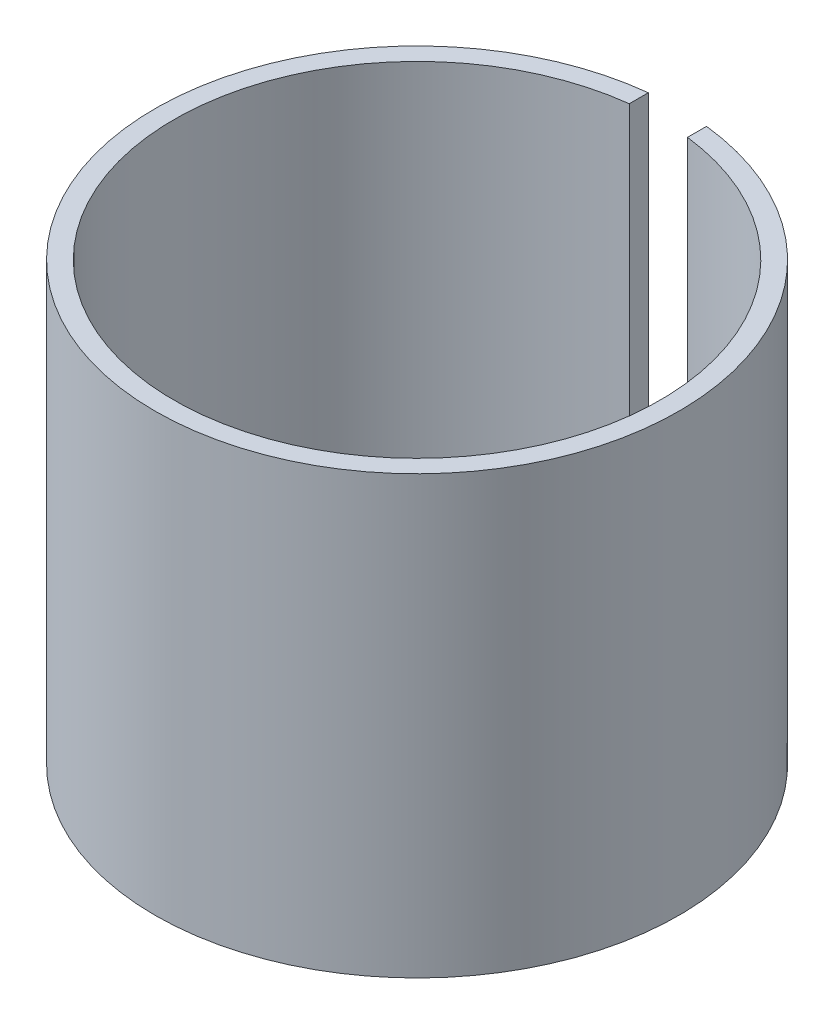
ISO-10303-21;
HEADER;
FILE_DESCRIPTION(('STEP AP214'),'2;1');
FILE_NAME('part.step','',(''),(''),'','','');
FILE_SCHEMA(('AUTOMOTIVE_DESIGN { 1 0 10303 214 1 1 1 1 }'));
ENDSEC;
DATA;
#1=APPLICATION_CONTEXT('core data for automotive mechanical design processes');
#2=APPLICATION_PROTOCOL_DEFINITION('international standard','automotive_design',2000,#1);
#3=PRODUCT_CONTEXT('',#1,'mechanical');
#4=PRODUCT('Part','Part','',(#3));
#5=PRODUCT_RELATED_PRODUCT_CATEGORY('part','',(#4));
#6=PRODUCT_DEFINITION_FORMATION('','',#4);
#7=PRODUCT_DEFINITION_CONTEXT('part definition',#1,'design');
#8=PRODUCT_DEFINITION('design','',#6,#7);
#9=PRODUCT_DEFINITION_SHAPE('','',#8);
#10=(LENGTH_UNIT() NAMED_UNIT(*) SI_UNIT(.MILLI.,.METRE.));
#11=(NAMED_UNIT(*) PLANE_ANGLE_UNIT() SI_UNIT($,.RADIAN.));
#12=(NAMED_UNIT(*) SI_UNIT($,.STERADIAN.) SOLID_ANGLE_UNIT());
#13=UNCERTAINTY_MEASURE_WITH_UNIT(LENGTH_MEASURE(1.E-05),#10,'distance_accuracy_value','');
#14=(GEOMETRIC_REPRESENTATION_CONTEXT(3) GLOBAL_UNCERTAINTY_ASSIGNED_CONTEXT((#13)) GLOBAL_UNIT_ASSIGNED_CONTEXT((#10,
#11,#12)) REPRESENTATION_CONTEXT('',''));
#15=CARTESIAN_POINT('',(0.,0.,0.));
#16=DIRECTION('',(0.,0.,1.));
#17=DIRECTION('',(1.,0.,0.));
#18=AXIS2_PLACEMENT_3D('',#15,#16,#17);
#19=CARTESIAN_POINT('',(0.,5.,0.));
#20=DIRECTION('',(0.,-1.,0.));
#21=DIRECTION('',(0.,0.,-1.));
#22=AXIS2_PLACEMENT_3D('',#19,#20,#21);
#23=CYLINDRICAL_SURFACE('',#22,18.);
#24=CARTESIAN_POINT('',(0.,30.,0.));
#25=DIRECTION('',(0.,1.,0.));
#26=DIRECTION('',(0.,0.,1.));
#27=AXIS2_PLACEMENT_3D('',#24,#25,#26);
#28=CIRCLE('',#27,18.);
#29=CARTESIAN_POINT('',(-2.,30.,-17.8885438199983));
#30=VERTEX_POINT('',#29);
#31=CARTESIAN_POINT('',(2.00000000000001,30.,-17.8885438199983));
#32=VERTEX_POINT('',#31);
#33=EDGE_CURVE('E111',#30,#32,#28,.T.);
#34=ORIENTED_EDGE('',*,*,#33,.F.);
#35=DIRECTION('',(0.,-1.,0.));
#36=VECTOR('',#35,1.);
#37=CARTESIAN_POINT('',(-2.,5.,-17.8885438199983));
#38=LINE('',#37,#36);
#39=CARTESIAN_POINT('',(-2.,5.,-17.8885438199983));
#40=VERTEX_POINT('',#39);
#41=EDGE_CURVE('E107',#30,#40,#38,.T.);
#42=ORIENTED_EDGE('',*,*,#41,.T.);
#43=CARTESIAN_POINT('',(0.,5.,0.));
#44=DIRECTION('',(0.,1.,0.));
#45=DIRECTION('',(0.,0.,1.));
#46=AXIS2_PLACEMENT_3D('',#43,#44,#45);
#47=CIRCLE('',#46,18.);
#48=CARTESIAN_POINT('',(2.00000000000001,5.,-17.8885438199983));
#49=VERTEX_POINT('',#48);
#50=EDGE_CURVE('E103',#49,#40,#47,.T.);
#51=ORIENTED_EDGE('',*,*,#50,.F.);
#52=DIRECTION('',(0.,-1.,0.));
#53=VECTOR('',#52,1.);
#54=CARTESIAN_POINT('',(2.00000000000001,5.,-17.8885438199983));
#55=LINE('',#54,#53);
#56=EDGE_CURVE('E88',#49,#32,#55,.F.);
#57=ORIENTED_EDGE('',*,*,#56,.T.);
#58=EDGE_LOOP('',(#34,#42,#51,#57));
#59=FACE_BOUND('',#58,.T.);
#60=CARTESIAN_POINT('',(0.,0.,0.));
#61=DIRECTION('',(0.,1.,0.));
#62=DIRECTION('',(0.,0.,1.));
#63=AXIS2_PLACEMENT_3D('',#60,#61,#62);
#64=CIRCLE('',#63,18.);
#65=CARTESIAN_POINT('',(0.,0.,18.));
#66=VERTEX_POINT('',#65);
#67=EDGE_CURVE('E54',#66,#66,#64,.T.);
#68=ORIENTED_EDGE('',*,*,#67,.T.);
#69=EDGE_LOOP('',(#68));
#70=FACE_BOUND('',#69,.T.);
#71=ADVANCED_FACE('F45',(#59,#70),#23,.T.);
#72=CARTESIAN_POINT('',(0.,0.,0.));
#73=DIRECTION('',(0.,1.,0.));
#74=DIRECTION('',(0.,0.,1.));
#75=AXIS2_PLACEMENT_3D('',#72,#73,#74);
#76=PLANE('',#75);
#77=CARTESIAN_POINT('',(0.,0.,-10.));
#78=DIRECTION('',(0.,-1.,0.));
#79=DIRECTION('',(0.,0.,-1.));
#80=AXIS2_PLACEMENT_3D('',#77,#78,#79);
#81=CIRCLE('',#80,2.);
#82=CARTESIAN_POINT('',(-1.71246204336909,0.,-8.96681378734511));
#83=VERTEX_POINT('',#82);
#84=EDGE_CURVE('E153',#83,#83,#81,.T.);
#85=ORIENTED_EDGE('',*,*,#84,.F.);
#86=EDGE_LOOP('',(#85));
#87=FACE_BOUND('',#86,.T.);
#88=ORIENTED_EDGE('',*,*,#67,.F.);
#89=EDGE_LOOP('',(#88));
#90=FACE_BOUND('',#89,.T.);
#91=ADVANCED_FACE('F140',(#87,#90),#76,.F.);
#92=CARTESIAN_POINT('',(0.,30.,0.));
#93=DIRECTION('',(0.,1.,0.));
#94=DIRECTION('',(0.,0.,1.));
#95=AXIS2_PLACEMENT_3D('',#92,#93,#94);
#96=PLANE('',#95);
#97=DIRECTION('',(0.,0.,1.));
#98=VECTOR('',#97,1.);
#99=CARTESIAN_POINT('',(-1.99999999999999,30.,-14.3872192523656));
#100=LINE('',#99,#98);
#101=CARTESIAN_POINT('',(-2.,30.,-16.5798069952578));
#102=VERTEX_POINT('',#101);
#103=EDGE_CURVE('E69',#30,#102,#100,.T.);
#104=ORIENTED_EDGE('',*,*,#103,.F.);
#105=ORIENTED_EDGE('',*,*,#33,.T.);
#106=DIRECTION('',(0.,0.,-1.));
#107=VECTOR('',#106,1.);
#108=CARTESIAN_POINT('',(2.00000000000001,30.,-14.3872192523656));
#109=LINE('',#108,#107);
#110=CARTESIAN_POINT('',(2.00000000000001,30.,-16.5798069952578));
#111=VERTEX_POINT('',#110);
#112=EDGE_CURVE('E94',#111,#32,#109,.T.);
#113=ORIENTED_EDGE('',*,*,#112,.F.);
#114=CARTESIAN_POINT('',(0.,30.,0.));
#115=DIRECTION('',(0.,1.,0.));
#116=DIRECTION('',(0.,0.,1.));
#117=AXIS2_PLACEMENT_3D('',#114,#115,#116);
#118=CIRCLE('',#117,16.7);
#119=EDGE_CURVE('E108',#102,#111,#118,.T.);
#120=ORIENTED_EDGE('',*,*,#119,.F.);
#121=EDGE_LOOP('',(#104,#105,#113,#120));
#122=FACE_BOUND('',#121,.T.);
#123=ADVANCED_FACE('F138',(#122),#96,.T.);
#124=CARTESIAN_POINT('',(0.,30.,0.));
#125=DIRECTION('',(0.,-1.,0.));
#126=DIRECTION('',(0.,0.,-1.));
#127=AXIS2_PLACEMENT_3D('',#124,#125,#126);
#128=CYLINDRICAL_SURFACE('',#127,16.7);
#129=DIRECTION('',(0.,-1.,0.));
#130=VECTOR('',#129,1.);
#131=CARTESIAN_POINT('',(-2.,30.,-16.5798069952578));
#132=LINE('',#131,#130);
#133=CARTESIAN_POINT('',(-2.,5.,-16.5798069952578));
#134=VERTEX_POINT('',#133);
#135=EDGE_CURVE('E99',#102,#134,#132,.T.);
#136=ORIENTED_EDGE('',*,*,#135,.F.);
#137=ORIENTED_EDGE('',*,*,#119,.T.);
#138=DIRECTION('',(0.,-1.,0.));
#139=VECTOR('',#138,1.);
#140=CARTESIAN_POINT('',(2.00000000000001,30.,-16.5798069952578));
#141=LINE('',#140,#139);
#142=CARTESIAN_POINT('',(2.00000000000001,5.,-16.5798069952578));
#143=VERTEX_POINT('',#142);
#144=EDGE_CURVE('E100',#143,#111,#141,.F.);
#145=ORIENTED_EDGE('',*,*,#144,.F.);
#146=CARTESIAN_POINT('',(0.,5.,0.));
#147=DIRECTION('',(0.,1.,0.));
#148=DIRECTION('',(0.,0.,1.));
#149=AXIS2_PLACEMENT_3D('',#146,#147,#148);
#150=CIRCLE('',#149,16.7);
#151=EDGE_CURVE('E12',#143,#134,#150,.F.);
#152=ORIENTED_EDGE('',*,*,#151,.T.);
#153=EDGE_LOOP('',(#136,#137,#145,#152));
#154=FACE_BOUND('',#153,.T.);
#155=ADVANCED_FACE('F137',(#154),#128,.F.);
#156=CARTESIAN_POINT('',(0.,5.,0.));
#157=DIRECTION('',(0.,1.,0.));
#158=DIRECTION('',(0.,0.,1.));
#159=AXIS2_PLACEMENT_3D('',#156,#157,#158);
#160=PLANE('',#159);
#161=CARTESIAN_POINT('',(0.,5.,-15.));
#162=DIRECTION('',(0.,1.,0.));
#163=DIRECTION('',(0.,0.,1.));
#164=AXIS2_PLACEMENT_3D('',#161,#162,#163);
#165=CIRCLE('',#164,2.);
#166=CARTESIAN_POINT('',(-1.50932755364611,5.,-13.6877765678801));
#167=VERTEX_POINT('',#166);
#168=EDGE_CURVE('E123',#167,#167,#165,.T.);
#169=ORIENTED_EDGE('',*,*,#168,.F.);
#170=EDGE_LOOP('',(#169));
#171=FACE_BOUND('',#170,.T.);
#172=ORIENTED_EDGE('',*,*,#151,.F.);
#173=DIRECTION('',(0.,0.,1.));
#174=VECTOR('',#173,1.);
#175=CARTESIAN_POINT('',(2.00000000000001,5.,-14.3872192523656));
#176=LINE('',#175,#174);
#177=EDGE_CURVE('E91',#49,#143,#176,.T.);
#178=ORIENTED_EDGE('',*,*,#177,.F.);
#179=ORIENTED_EDGE('',*,*,#50,.T.);
#180=DIRECTION('',(0.,0.,-1.));
#181=VECTOR('',#180,1.);
#182=CARTESIAN_POINT('',(-1.99999999999999,5.,-14.3872192523656));
#183=LINE('',#182,#181);
#184=EDGE_CURVE('E62',#134,#40,#183,.T.);
#185=ORIENTED_EDGE('',*,*,#184,.F.);
#186=EDGE_LOOP('',(#172,#178,#179,#185));
#187=FACE_BOUND('',#186,.T.);
#188=ADVANCED_FACE('F102',(#171,#187),#160,.T.);
#189=CARTESIAN_POINT('',(-1.99999999999999,-1.11521210969115,-14.3872192523656));
#190=DIRECTION('',(-1.,0.,0.));
#191=DIRECTION('',(0.,0.,1.));
#192=AXIS2_PLACEMENT_3D('',#189,#190,#191);
#193=PLANE('',#192);
#194=ORIENTED_EDGE('',*,*,#103,.T.);
#195=ORIENTED_EDGE('',*,*,#135,.T.);
#196=ORIENTED_EDGE('',*,*,#184,.T.);
#197=ORIENTED_EDGE('',*,*,#41,.F.);
#198=EDGE_LOOP('',(#194,#195,#196,#197));
#199=FACE_BOUND('',#198,.T.);
#200=ADVANCED_FACE('F136',(#199),#193,.F.);
#201=CARTESIAN_POINT('',(2.00000000000001,-1.11521210969115,-14.3872192523656));
#202=DIRECTION('',(1.,0.,0.));
#203=DIRECTION('',(0.,0.,-1.));
#204=AXIS2_PLACEMENT_3D('',#201,#202,#203);
#205=PLANE('',#204);
#206=ORIENTED_EDGE('',*,*,#177,.T.);
#207=ORIENTED_EDGE('',*,*,#144,.T.);
#208=ORIENTED_EDGE('',*,*,#112,.T.);
#209=ORIENTED_EDGE('',*,*,#56,.F.);
#210=EDGE_LOOP('',(#206,#207,#208,#209));
#211=FACE_BOUND('',#210,.T.);
#212=ADVANCED_FACE('F90',(#211),#205,.F.);
#213=CARTESIAN_POINT('',(-1.71246204336909,0.,-8.96681378734511));
#214=CARTESIAN_POINT('',(-1.50932755364611,5.,-13.6877765678801));
#215=CARTESIAN_POINT('',(-1.62636319231452,0.,-8.82410861706435));
#216=CARTESIAN_POINT('',(-1.39997560096945,5.,-13.5619992717429));
#217=CARTESIAN_POINT('',(-1.51161522329544,0.,-8.673150148731));
#218=CARTESIAN_POINT('',(-1.26098215289133,5.,-13.433017191798));
#219=CARTESIAN_POINT('',(-1.19772762088648,0.,-8.38415357868493));
#220=CARTESIAN_POINT('',(-0.902081628122035,5.,-13.2022903884899));
#221=CARTESIAN_POINT('',(-0.997261399921723,0.,-8.24598152480161));
#222=CARTESIAN_POINT('',(-0.680844687362737,5.,-13.1006417866024));
#223=CARTESIAN_POINT('',(-0.502854414282958,0.,-8.04596608290765));
#224=CARTESIAN_POINT('',(-0.159411279927104,5.,-12.9886076576304));
#225=CARTESIAN_POINT('',(-0.20751605977832,0.,-7.98620736714704));
#226=CARTESIAN_POINT('',(0.141803549701195,5.,-12.9805160469836));
#227=CARTESIAN_POINT('',(0.41905686482192,0.,-8.01939023852643));
#228=CARTESIAN_POINT('',(0.753341280020018,5.,-13.120930922234));
#229=CARTESIAN_POINT('',(0.747775872093373,0.,-8.11534025452176));
#230=CARTESIAN_POINT('',(1.06066883984559,5.,-13.2719685410006));
#231=CARTESIAN_POINT('',(1.3185965532164,0.,-8.45973565874005));
#232=CARTESIAN_POINT('',(1.5637780243943,5.,-13.7093763517072));
#233=CARTESIAN_POINT('',(1.55674791093564,0.,-8.70579768776428));
#234=CARTESIAN_POINT('',(1.75607792465688,5.,-13.9927194999745));
#235=CARTESIAN_POINT('',(1.87825085809684,0.,-9.2446210240831));
#236=CARTESIAN_POINT('',(1.98015406486878,5.,-14.5787951061746));
#237=CARTESIAN_POINT('',(1.96309092816853,0.,-9.5337542291307));
#238=CARTESIAN_POINT('',(2.01402039732329,5.,-14.8782093998831));
#239=CARTESIAN_POINT('',(2.01667179640788,0.,-10.0643892590742));
#240=CARTESIAN_POINT('',(1.97557180705442,5.,-15.4101550271335));
#241=CARTESIAN_POINT('',(1.98790843632494,0.,-10.3061554505464));
#242=CARTESIAN_POINT('',(1.90567010900737,5.,-15.6433758984816));
#243=CARTESIAN_POINT('',(1.87860296603046,0.,-10.7185833334643));
#244=CARTESIAN_POINT('',(1.72708391598033,5.,-16.0308696611469));
#245=CARTESIAN_POINT('',(1.79856089442367,0.,-10.8904810423741));
#246=CARTESIAN_POINT('',(1.61867950632277,5.,-16.1864461359828));
#247=CARTESIAN_POINT('',(1.62636319231452,0.,-11.1758913829356));
#248=CARTESIAN_POINT('',(1.39997560096945,5.,-16.4380007282571));
#249=CARTESIAN_POINT('',(1.51161522329544,0.,-11.326849851269));
#250=CARTESIAN_POINT('',(1.26098215289133,5.,-16.566982808202));
#251=CARTESIAN_POINT('',(1.19772762088648,0.,-11.6158464213151));
#252=CARTESIAN_POINT('',(0.902081628122036,5.,-16.7977096115101));
#253=CARTESIAN_POINT('',(0.997261399921723,0.,-11.7540184751984));
#254=CARTESIAN_POINT('',(0.680844687362738,5.,-16.8993582133977));
#255=CARTESIAN_POINT('',(0.502854414282958,0.,-11.9540339170923));
#256=CARTESIAN_POINT('',(0.159411279927106,5.,-17.0113923423696));
#257=CARTESIAN_POINT('',(0.20751605977832,0.,-12.013792632853));
#258=CARTESIAN_POINT('',(-0.141803549701194,5.,-17.0194839530164));
#259=CARTESIAN_POINT('',(-0.419056864821919,0.,-11.9806097614736));
#260=CARTESIAN_POINT('',(-0.753341280020017,5.,-16.8790690777661));
#261=CARTESIAN_POINT('',(-0.747775872093373,0.,-11.8846597454782));
#262=CARTESIAN_POINT('',(-1.06066883984559,5.,-16.7280314589994));
#263=CARTESIAN_POINT('',(-1.3185965532164,0.,-11.5402643412599));
#264=CARTESIAN_POINT('',(-1.5637780243943,5.,-16.2906236482928));
#265=CARTESIAN_POINT('',(-1.55674791093564,0.,-11.2942023122357));
#266=CARTESIAN_POINT('',(-1.75607792465688,5.,-16.0072805000255));
#267=CARTESIAN_POINT('',(-1.87825085809684,0.,-10.7553789759169));
#268=CARTESIAN_POINT('',(-1.98015406486878,5.,-15.4212048938254));
#269=CARTESIAN_POINT('',(-1.96309092816853,0.,-10.4662457708693));
#270=CARTESIAN_POINT('',(-2.0140203973233,5.,-15.1217906001169));
#271=CARTESIAN_POINT('',(-2.01667179640788,0.,-9.93561074092579));
#272=CARTESIAN_POINT('',(-1.97557180705442,5.,-14.5898449728665));
#273=CARTESIAN_POINT('',(-1.98790843632493,0.,-9.69384454945361));
#274=CARTESIAN_POINT('',(-1.90567010900737,5.,-14.3566241015184));
#275=CARTESIAN_POINT('',(-1.87860296603046,0.,-9.2814166665357));
#276=CARTESIAN_POINT('',(-1.72708391598033,5.,-13.9691303388531));
#277=CARTESIAN_POINT('',(-1.79856089442367,0.,-9.10951895762587));
#278=CARTESIAN_POINT('',(-1.61867950632277,5.,-13.8135538640172));
#279=CARTESIAN_POINT('',(-1.71246204336909,0.,-8.96681378734511));
#280=CARTESIAN_POINT('',(-1.50932755364611,5.,-13.6877765678801));
#281=B_SPLINE_SURFACE_WITH_KNOTS('',3,1,((#213,#214),(#215,#216),(#217,#218),(#219,#220),(#221,
#222),(#223,#224),(#225,#226),(#227,#228),(#229,#230),(#231,#232),(#233,#234),(#235,#236),(#237,
#238),(#239,#240),(#241,#242),(#243,#244),(#245,#246),(#247,#248),(#249,#250),(#251,#252),(#253,
#254),(#255,#256),(#257,#258),(#259,#260),(#261,#262),(#263,#264),(#265,#266),(#267,#268),(#269,
#270),(#271,#272),(#273,#274),(#275,#276),(#277,#278),(#279,#280)),.UNSPECIFIED.,.T.,.F.,.F.,(4,
2,2,2,2,2,2,2,2,2,2,2,2,2,2,2,4),(2,2),(0.,0.0625,0.125,0.1875,0.25,0.3125,0.375,0.4375,0.5,
0.5625,0.625,0.6875,0.75,0.8125,0.875,0.9375,1.),(0.,1.),.UNSPECIFIED.);
#282=CARTESIAN_POINT('',(-1.71246204336909,0.,-8.96681378734511));
#283=CARTESIAN_POINT('',(-1.71034605910114,0.0520833333333329,-9.01599048297568));
#284=CARTESIAN_POINT('',(-1.7082300748332,0.104166666666666,-9.06516717860626));
#285=CARTESIAN_POINT('',(-1.7039981062973,0.208333333333333,-9.1635205698674));
#286=CARTESIAN_POINT('',(-1.70188212202935,0.260416666666667,-9.21269726549797));
#287=CARTESIAN_POINT('',(-1.69765015349346,0.364583333333333,-9.31105065675912));
#288=CARTESIAN_POINT('',(-1.69553416922551,0.416666666666667,-9.36022735238969));
#289=CARTESIAN_POINT('',(-1.69130220068961,0.520833333333333,-9.45858074365083));
#290=CARTESIAN_POINT('',(-1.68918621642167,0.572916666666667,-9.50775743928141));
#291=CARTESIAN_POINT('',(-1.68495424788577,0.677083333333334,-9.60611083054255));
#292=CARTESIAN_POINT('',(-1.68283826361782,0.729166666666667,-9.65528752617312));
#293=CARTESIAN_POINT('',(-1.67860629508193,0.833333333333333,-9.75364091743427));
#294=CARTESIAN_POINT('',(-1.67649031081398,0.885416666666667,-9.80281761306484));
#295=CARTESIAN_POINT('',(-1.67225834227809,0.989583333333333,-9.90117100432598));
#296=CARTESIAN_POINT('',(-1.67014235801014,1.04166666666667,-9.95034769995656));
#297=CARTESIAN_POINT('',(-1.66591038947424,1.14583333333333,-10.0487010912177));
#298=CARTESIAN_POINT('',(-1.66379440520629,1.19791666666667,-10.0978777868483));
#299=CARTESIAN_POINT('',(-1.6595624366704,1.30208333333333,-10.1962311781094));
#300=CARTESIAN_POINT('',(-1.65744645240245,1.35416666666667,-10.24540787374));
#301=CARTESIAN_POINT('',(-1.65321448386656,1.45833333333333,-10.3437612650011));
#302=CARTESIAN_POINT('',(-1.65109849959861,1.51041666666667,-10.3929379606317));
#303=CARTESIAN_POINT('',(-1.64686653106271,1.61458333333333,-10.4912913518929));
#304=CARTESIAN_POINT('',(-1.64475054679476,1.66666666666667,-10.5404680475234));
#305=CARTESIAN_POINT('',(-1.64051857825887,1.77083333333333,-10.6388214387846));
#306=CARTESIAN_POINT('',(-1.63840259399092,1.82291666666667,-10.6879981344151));
#307=CARTESIAN_POINT('',(-1.63417062545503,1.92708333333333,-10.7863515256763));
#308=CARTESIAN_POINT('',(-1.63205464118708,1.97916666666667,-10.8355282213069));
#309=CARTESIAN_POINT('',(-1.62782267265118,2.08333333333333,-10.933881612568));
#310=CARTESIAN_POINT('',(-1.62570668838324,2.13541666666667,-10.9830583081986));
#311=CARTESIAN_POINT('',(-1.62147471984734,2.23958333333333,-11.0814116994597));
#312=CARTESIAN_POINT('',(-1.61935873557939,2.29166666666667,-11.1305883950903));
#313=CARTESIAN_POINT('',(-1.6151267670435,2.39583333333333,-11.2289417863514));
#314=CARTESIAN_POINT('',(-1.61301078277555,2.44791666666667,-11.278118481982));
#315=CARTESIAN_POINT('',(-1.60877881423965,2.55208333333333,-11.3764718732432));
#316=CARTESIAN_POINT('',(-1.60666282997171,2.60416666666667,-11.4256485688737));
#317=CARTESIAN_POINT('',(-1.60243086143581,2.70833333333333,-11.5240019601349));
#318=CARTESIAN_POINT('',(-1.60031487716786,2.76041666666667,-11.5731786557654));
#319=CARTESIAN_POINT('',(-1.59608290863197,2.86458333333333,-11.6715320470266));
#320=CARTESIAN_POINT('',(-1.59396692436402,2.91666666666667,-11.7207087426572));
#321=CARTESIAN_POINT('',(-1.58973495582812,3.02083333333333,-11.8190621339183));
#322=CARTESIAN_POINT('',(-1.58761897156018,3.07291666666667,-11.8682388295489));
#323=CARTESIAN_POINT('',(-1.58338700302428,3.17708333333333,-11.96659222081));
#324=CARTESIAN_POINT('',(-1.58127101875633,3.22916666666667,-12.0157689164406));
#325=CARTESIAN_POINT('',(-1.57703905022044,3.33333333333333,-12.1141223077017));
#326=CARTESIAN_POINT('',(-1.57492306595249,3.38541666666667,-12.1632990033323));
#327=CARTESIAN_POINT('',(-1.57069109741659,3.48958333333333,-12.2616523945935));
#328=CARTESIAN_POINT('',(-1.56857511314865,3.54166666666667,-12.310829090224));
#329=CARTESIAN_POINT('',(-1.56434314461275,3.64583333333333,-12.4091824814852));
#330=CARTESIAN_POINT('',(-1.5622271603448,3.69791666666667,-12.4583591771157));
#331=CARTESIAN_POINT('',(-1.55799519180891,3.80208333333333,-12.5567125683769));
#332=CARTESIAN_POINT('',(-1.55587920754096,3.85416666666667,-12.6058892640075));
#333=CARTESIAN_POINT('',(-1.55164723900506,3.95833333333333,-12.7042426552686));
#334=CARTESIAN_POINT('',(-1.54953125473712,4.01041666666667,-12.7534193508992));
#335=CARTESIAN_POINT('',(-1.54529928620122,4.11458333333333,-12.8517727421603));
#336=CARTESIAN_POINT('',(-1.54318330193327,4.16666666666667,-12.9009494377909));
#337=CARTESIAN_POINT('',(-1.53895133339738,4.27083333333333,-12.999302829052));
#338=CARTESIAN_POINT('',(-1.53683534912943,4.32291666666667,-13.0484795246826));
#339=CARTESIAN_POINT('',(-1.53260338059354,4.42708333333333,-13.1468329159438));
#340=CARTESIAN_POINT('',(-1.53048739632559,4.47916666666667,-13.1960096115743));
#341=CARTESIAN_POINT('',(-1.52625542778969,4.58333333333333,-13.2943630028355));
#342=CARTESIAN_POINT('',(-1.52413944352174,4.63541666666667,-13.343539698466));
#343=CARTESIAN_POINT('',(-1.51990747498585,4.73958333333333,-13.4418930897272));
#344=CARTESIAN_POINT('',(-1.5177914907179,4.79166666666667,-13.4910697853578));
#345=CARTESIAN_POINT('',(-1.51355952218201,4.89583333333333,-13.5894231766189));
#346=CARTESIAN_POINT('',(-1.51144353791406,4.94791666666667,-13.6385998722495));
#347=CARTESIAN_POINT('',(-1.50932755364611,5.,-13.6877765678801));
#348=B_SPLINE_CURVE_WITH_KNOTS('',3,(#282,#283,#284,#285,#286,#287,#288,#289,#290,#291,#292,
#293,#294,#295,#296,#297,#298,#299,#300,#301,#302,#303,#304,#305,#306,#307,#308,#309,#310,#311,
#312,#313,#314,#315,#316,#317,#318,#319,#320,#321,#322,#323,#324,#325,#326,#327,#328,#329,#330,
#331,#332,#333,#334,#335,#336,#337,#338,#339,#340,#341,#342,#343,#344,#345,#346,#347),
.UNSPECIFIED.,.F.,.F.,(4,2,2,2,2,2,2,2,2,2,2,2,2,2,2,2,2,2,2,2,2,2,2,2,2,2,2,2,2,2,2,2,4),(0.,
0.214987175299081,0.42997435059816,0.64496152589724,0.85994870119632,1.0749358764954,
1.28992305179448,1.50491022709356,1.71989740239264,1.93488457769172,2.1498717529908,
2.36485892828988,2.57984610358896,2.79483327888804,3.00982045418712,3.2248076294862,
3.43979480478528,3.65478198008436,3.86976915538344,4.08475633068252,4.2997435059816,
4.51473068128068,4.72971785657976,4.94470503187884,5.15969220717792,5.374679382477,
5.58966655777608,5.80465373307516,6.01964090837424,6.23462808367332,6.4496152589724,
6.66460243427148,6.87958960957056),.UNSPECIFIED.);
#349=EDGE_CURVE('BSEAM182',#83,#167,#348,.T.);
#350=ORIENTED_EDGE('',*,*,#84,.T.);
#351=ORIENTED_EDGE('',*,*,#168,.T.);
#352=ORIENTED_EDGE('',*,*,#349,.T.);
#353=ORIENTED_EDGE('',*,*,#349,.F.);
#354=EDGE_LOOP('',(#350,#352,#351,#353));
#355=FACE_BOUND('',#354,.T.);
#356=ADVANCED_FACE('F182',(#355),#281,.F.);
#357=CLOSED_SHELL('',(#71,#91,#123,#155,#188,#200,#212,#356));
#358=MANIFOLD_SOLID_BREP('B2',#357);
#359=ADVANCED_BREP_SHAPE_REPRESENTATION('',(#18,#358),#14);
#360=SHAPE_DEFINITION_REPRESENTATION(#9,#359);
ENDSEC;
END-ISO-10303-21;
